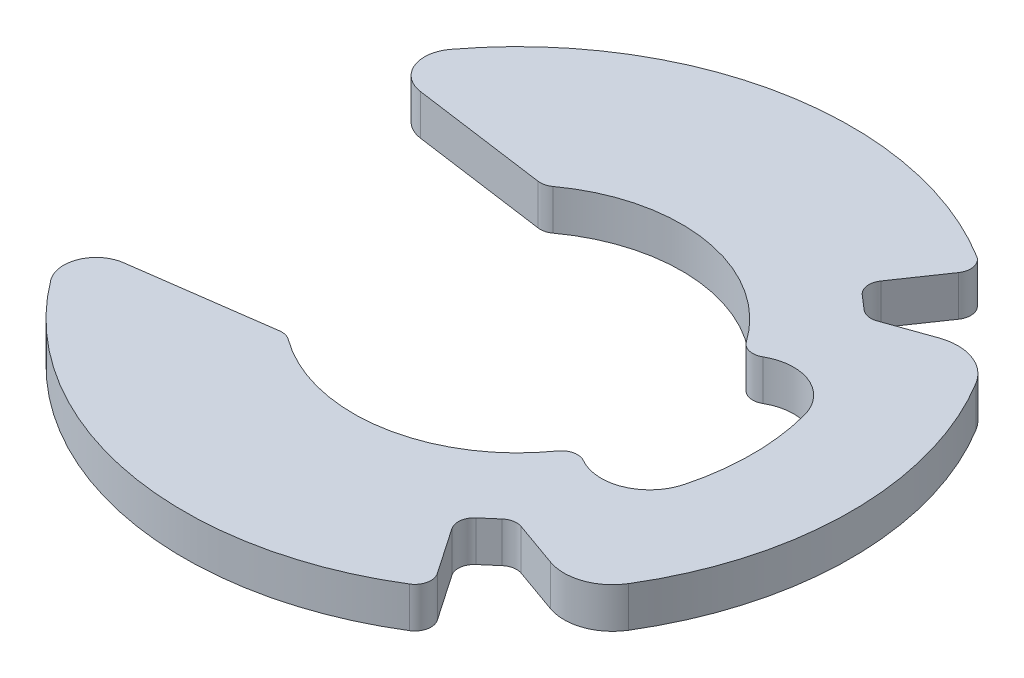
ISO-10303-21;
HEADER;
FILE_DESCRIPTION(('STEP AP214'),'2;1');
FILE_NAME('part.step','',(''),(''),'','','');
FILE_SCHEMA(('AUTOMOTIVE_DESIGN { 1 0 10303 214 1 1 1 1 }'));
ENDSEC;
DATA;
#1=APPLICATION_CONTEXT('core data for automotive mechanical design processes');
#2=APPLICATION_PROTOCOL_DEFINITION('international standard','automotive_design',2000,#1);
#3=PRODUCT_CONTEXT('',#1,'mechanical');
#4=PRODUCT('Part','Part','',(#3));
#5=PRODUCT_RELATED_PRODUCT_CATEGORY('part','',(#4));
#6=PRODUCT_DEFINITION_FORMATION('','',#4);
#7=PRODUCT_DEFINITION_CONTEXT('part definition',#1,'design');
#8=PRODUCT_DEFINITION('design','',#6,#7);
#9=PRODUCT_DEFINITION_SHAPE('','',#8);
#10=(LENGTH_UNIT() NAMED_UNIT(*) SI_UNIT(.MILLI.,.METRE.));
#11=(NAMED_UNIT(*) PLANE_ANGLE_UNIT() SI_UNIT($,.RADIAN.));
#12=(NAMED_UNIT(*) SI_UNIT($,.STERADIAN.) SOLID_ANGLE_UNIT());
#13=UNCERTAINTY_MEASURE_WITH_UNIT(LENGTH_MEASURE(1.E-05),#10,'distance_accuracy_value','');
#14=(GEOMETRIC_REPRESENTATION_CONTEXT(3) GLOBAL_UNCERTAINTY_ASSIGNED_CONTEXT((#13)) GLOBAL_UNIT_ASSIGNED_CONTEXT((#10,
#11,#12)) REPRESENTATION_CONTEXT('',''));
#15=CARTESIAN_POINT('',(0.,0.,0.));
#16=DIRECTION('',(0.,0.,1.));
#17=DIRECTION('',(1.,0.,0.));
#18=AXIS2_PLACEMENT_3D('',#15,#16,#17);
#19=CARTESIAN_POINT('',(0.,0.,0.));
#20=DIRECTION('',(0.,1.,0.));
#21=DIRECTION('',(0.,0.,1.));
#22=AXIS2_PLACEMENT_3D('',#19,#20,#21);
#23=PLANE('',#22);
#24=CARTESIAN_POINT('',(-22.07313236114,4.47034770312271E-10,-16.01345085594));
#25=DIRECTION('',(0.,-1.,0.));
#26=DIRECTION('',(0.,0.,-1.));
#27=AXIS2_PLACEMENT_3D('',#24,#25,#26);
#28=CIRCLE('',#27,0.50800000118196);
#29=CARTESIAN_POINT('',(-21.8057551545529,4.47034770312271E-10,-16.4453923260195));
#30=VERTEX_POINT('',#29);
#31=CARTESIAN_POINT('',(-21.6539452885202,4.47034811882136E-10,-15.7264905792936));
#32=VERTEX_POINT('',#31);
#33=EDGE_CURVE('E217',#30,#32,#28,.T.);
#34=ORIENTED_EDGE('',*,*,#33,.T.);
#35=DIRECTION('',(-0.564882433563304,0.,0.82517139810563));
#36=VECTOR('',#35,1.);
#37=CARTESIAN_POINT('',(-22.0748487406788,4.47034853452E-10,-15.1116414187447));
#38=LINE('',#37,#36);
#39=CARTESIAN_POINT('',(-22.6486653216856,4.47034770312271E-10,-14.2734191628065));
#40=VERTEX_POINT('',#39);
#41=EDGE_CURVE('E254',#32,#40,#38,.T.);
#42=ORIENTED_EDGE('',*,*,#41,.T.);
#43=CARTESIAN_POINT('',(-22.22947825114,4.47034770312271E-10,-13.98645888758));
#44=DIRECTION('',(0.,-1.,0.));
#45=DIRECTION('',(0.,0.,-1.));
#46=AXIS2_PLACEMENT_3D('',#43,#44,#45);
#47=CIRCLE('',#46,0.508000002280017);
#48=CARTESIAN_POINT('',(-22.5611715821282,4.47034811882136E-10,-13.6016946235873));
#49=VERTEX_POINT('',#48);
#50=EDGE_CURVE('E250',#40,#49,#47,.F.);
#51=ORIENTED_EDGE('',*,*,#50,.T.);
#52=DIRECTION('',(0.757409961678544,0.,0.652939621979021));
#53=VECTOR('',#52,1.);
#54=CARTESIAN_POINT('',(-2.89188515223315,4.47034853452E-10,3.35458677740044));
#55=LINE('',#54,#53);
#56=CARTESIAN_POINT('',(-22.1206645648755,4.47034770312271E-10,-13.2219471969928));
#57=VERTEX_POINT('',#56);
#58=EDGE_CURVE('E246',#49,#57,#55,.T.);
#59=ORIENTED_EDGE('',*,*,#58,.T.);
#60=CARTESIAN_POINT('',(-21.78897123528,0.,-13.6067114581));
#61=DIRECTION('',(0.,-1.,0.));
#62=DIRECTION('',(0.,0.,-1.));
#63=AXIS2_PLACEMENT_3D('',#60,#61,#62);
#64=CIRCLE('',#63,0.507999999762464);
#65=CARTESIAN_POINT('',(-21.6191707881146,0.,-13.1279298714654));
#66=VERTEX_POINT('',#65);
#67=EDGE_CURVE('E214',#57,#66,#64,.F.);
#68=ORIENTED_EDGE('',*,*,#67,.T.);
#69=DIRECTION('',(-0.942483439821768,0.,0.334252846901455));
#70=VECTOR('',#69,1.);
#71=CARTESIAN_POINT('',(-20.18646760006,0.,-13.63603972304));
#72=LINE('',#71,#70);
#73=CARTESIAN_POINT('',(-20.1864675987335,2.23517385156136E-10,-13.6360397235104));
#74=VERTEX_POINT('',#73);
#75=EDGE_CURVE('E210',#74,#66,#72,.T.);
#76=ORIENTED_EDGE('',*,*,#75,.F.);
#77=CARTESIAN_POINT('',(-19.6770662592,4.47034770312271E-10,-12.19969496302));
#78=DIRECTION('',(0.,-1.,0.));
#79=DIRECTION('',(0.,0.,-1.));
#80=AXIS2_PLACEMENT_3D('',#77,#78,#79);
#81=CIRCLE('',#80,1.5239999985915);
#82=CARTESIAN_POINT('',(-18.3760715779661,4.47034770312271E-10,-12.9934133257918));
#83=VERTEX_POINT('',#82);
#84=EDGE_CURVE('E20',#83,#74,#81,.F.);
#85=ORIENTED_EDGE('',*,*,#84,.F.);
#86=CARTESIAN_POINT('',(-27.3204100022,4.47034770312271E-10,-7.53659958514));
#87=DIRECTION('',(0.,-1.,0.));
#88=DIRECTION('',(0.,0.,-1.));
#89=AXIS2_PLACEMENT_3D('',#86,#87,#88);
#90=CIRCLE('',#89,10.4774999889218);
#91=CARTESIAN_POINT('',(-18.3760715791694,4.47034770312271E-10,-2.07978584547633));
#92=VERTEX_POINT('',#91);
#93=EDGE_CURVE('E401',#83,#92,#90,.T.);
#94=ORIENTED_EDGE('',*,*,#93,.T.);
#95=CARTESIAN_POINT('',(-19.6770662592,0.,-2.87350420726));
#96=DIRECTION('',(0.,-1.,0.));
#97=DIRECTION('',(0.,0.,-1.));
#98=AXIS2_PLACEMENT_3D('',#95,#96,#97);
#99=CIRCLE('',#98,1.523999999238);
#100=CARTESIAN_POINT('',(-20.1864676003209,2.23517426726E-10,-1.43715944347087));
#101=VERTEX_POINT('',#100);
#102=EDGE_CURVE('E399',#92,#101,#99,.T.);
#103=ORIENTED_EDGE('',*,*,#102,.T.);
#104=DIRECTION('',(-0.942483439574692,0.,-0.334252847598129));
#105=VECTOR('',#104,1.);
#106=CARTESIAN_POINT('',(-1.80258726924936,4.47034853452E-10,5.08270508946653));
#107=LINE('',#106,#105);
#108=CARTESIAN_POINT('',(-21.6191707898387,4.47034770312271E-10,-1.94526929709942));
#109=VERTEX_POINT('',#108);
#110=EDGE_CURVE('E275',#101,#109,#107,.T.);
#111=ORIENTED_EDGE('',*,*,#110,.T.);
#112=CARTESIAN_POINT('',(-21.78897123528,4.47034770312271E-10,-1.466487711164));
#113=DIRECTION('',(0.,-1.,0.));
#114=DIRECTION('',(0.,0.,-1.));
#115=AXIS2_PLACEMENT_3D('',#112,#113,#114);
#116=CIRCLE('',#115,0.50800000093334);
#117=CARTESIAN_POINT('',(-22.120664564575,4.47034811882136E-10,-1.85125197230361));
#118=VERTEX_POINT('',#117);
#119=EDGE_CURVE('E397',#109,#118,#116,.F.);
#120=ORIENTED_EDGE('',*,*,#119,.T.);
#121=DIRECTION('',(-0.757409961678544,0.,0.652939621979021));
#122=VECTOR('',#121,1.);
#123=CARTESIAN_POINT('',(-10.3462298969316,4.47034853452E-10,-12.0016266833385));
#124=LINE('',#123,#122);
#125=CARTESIAN_POINT('',(-22.5611715802731,4.47034770312271E-10,-1.47150454466788));
#126=VERTEX_POINT('',#125);
#127=EDGE_CURVE('E271',#118,#126,#124,.T.);
#128=ORIENTED_EDGE('',*,*,#127,.T.);
#129=CARTESIAN_POINT('',(-22.22947825114,4.47034770312271E-10,-1.086740283716));
#130=DIRECTION('',(0.,-1.,0.));
#131=DIRECTION('',(0.,0.,-1.));
#132=AXIS2_PLACEMENT_3D('',#129,#130,#131);
#133=CIRCLE('',#132,0.508000000775935);
#134=CARTESIAN_POINT('',(-22.6486653201538,4.47034811882136E-10,-0.799780008649158));
#135=VERTEX_POINT('',#134);
#136=EDGE_CURVE('E395',#126,#135,#133,.F.);
#137=ORIENTED_EDGE('',*,*,#136,.T.);
#138=DIRECTION('',(0.564882433563304,0.,0.82517139810563));
#139=VECTOR('',#138,1.);
#140=CARTESIAN_POINT('',(-15.048856378588,4.47034853452E-10,10.3019016812714));
#141=LINE('',#140,#139);
#142=CARTESIAN_POINT('',(-21.65394529083,4.47034770312271E-10,0.653291409725379));
#143=VERTEX_POINT('',#142);
#144=EDGE_CURVE('E267',#135,#143,#141,.T.);
#145=ORIENTED_EDGE('',*,*,#144,.T.);
#146=CARTESIAN_POINT('',(-22.07313236114,4.47034770312271E-10,0.940251686676));
#147=DIRECTION('',(0.,-1.,0.));
#148=DIRECTION('',(0.,0.,-1.));
#149=AXIS2_PLACEMENT_3D('',#146,#147,#148);
#150=CIRCLE('',#149,0.50799999882348);
#151=CARTESIAN_POINT('',(-21.8057551567268,4.47034770312271E-10,1.37219315238051));
#152=VERTEX_POINT('',#151);
#153=EDGE_CURVE('E392',#143,#152,#150,.T.);
#154=ORIENTED_EDGE('',*,*,#153,.T.);
#155=CARTESIAN_POINT('',(-27.3204100022,0.,-7.53659958514));
#156=DIRECTION('',(0.,-1.,0.));
#157=DIRECTION('',(0.,0.,-1.));
#158=AXIS2_PLACEMENT_3D('',#155,#156,#157);
#159=CIRCLE('',#158,10.4775);
#160=CARTESIAN_POINT('',(-35.7109114566552,2.47519251875367E-10,-1.26145085025943));
#161=VERTEX_POINT('',#160);
#162=EDGE_CURVE('E389',#152,#161,#159,.T.);
#163=ORIENTED_EDGE('',*,*,#162,.T.);
#164=CARTESIAN_POINT('',(-34.897287076,4.47034770312271E-10,-1.869950119884));
#165=DIRECTION('',(0.,-1.,0.));
#166=DIRECTION('',(0.,0.,-1.));
#167=AXIS2_PLACEMENT_3D('',#164,#165,#166);
#168=CIRCLE('',#167,1.01599999949862);
#169=CARTESIAN_POINT('',(-35.0366255019701,4.47034770312271E-10,-2.87635004495265));
#170=VERTEX_POINT('',#169);
#171=EDGE_CURVE('E386',#161,#170,#168,.T.);
#172=ORIENTED_EDGE('',*,*,#171,.T.);
#173=DIRECTION('',(0.990551105107822,0.,-0.137144114600928));
#174=VECTOR('',#173,1.);
#175=CARTESIAN_POINT('',(-1.0497337892879,4.47034631456E-10,-7.58191460183239));
#176=LINE('',#175,#174);
#177=CARTESIAN_POINT('',(-30.738662072202,4.47034770312271E-10,-3.47141312136189));
#178=VERTEX_POINT('',#177);
#179=EDGE_CURVE('E262',#170,#178,#176,.T.);
#180=ORIENTED_EDGE('',*,*,#179,.T.);
#181=CARTESIAN_POINT('',(-30.6689928656,4.47034770312271E-10,-2.96821315932));
#182=DIRECTION('',(0.,-1.,0.));
#183=DIRECTION('',(0.,0.,-1.));
#184=AXIS2_PLACEMENT_3D('',#181,#182,#183);
#185=CIRCLE('',#184,0.508000000000001);
#186=CARTESIAN_POINT('',(-30.368671526695,4.47034770312271E-10,-3.37793391468232));
#187=VERTEX_POINT('',#186);
#188=EDGE_CURVE('E383',#178,#187,#185,.T.);
#189=ORIENTED_EDGE('',*,*,#188,.T.);
#190=CARTESIAN_POINT('',(-27.3204100022,0.,-7.53659958514));
#191=DIRECTION('',(0.,-1.,0.));
#192=DIRECTION('',(0.,0.,-1.));
#193=AXIS2_PLACEMENT_3D('',#190,#191,#192);
#194=CIRCLE('',#193,5.15619998974764);
#195=CARTESIAN_POINT('',(-23.1042244003276,2.03470982844795E-10,-4.56840530160036));
#196=VERTEX_POINT('',#195);
#197=EDGE_CURVE('E379',#187,#196,#194,.F.);
#198=ORIENTED_EDGE('',*,*,#197,.T.);
#199=CARTESIAN_POINT('',(-22.68883665424,4.47034770312271E-10,-4.27597236752));
#200=DIRECTION('',(0.,-1.,0.));
#201=DIRECTION('',(0.,0.,-1.));
#202=AXIS2_PLACEMENT_3D('',#199,#200,#201);
#203=CIRCLE('',#202,0.508);
#204=CARTESIAN_POINT('',(-22.4351958276829,4.47034770312271E-10,-4.71612044585406));
#205=VERTEX_POINT('',#204);
#206=EDGE_CURVE('E375',#196,#205,#203,.T.);
#207=ORIENTED_EDGE('',*,*,#206,.T.);
#208=CARTESIAN_POINT('',(-21.67427334682,0.,-6.03656468072));
#209=DIRECTION('',(0.,-1.,0.));
#210=DIRECTION('',(0.,0.,-1.));
#211=AXIS2_PLACEMENT_3D('',#208,#209,#210);
#212=CIRCLE('',#211,1.52400000241032);
#213=CARTESIAN_POINT('',(-20.201368126617,1.652085018479E-10,-5.6452512262548));
#214=VERTEX_POINT('',#213);
#215=EDGE_CURVE('E372',#205,#214,#212,.F.);
#216=ORIENTED_EDGE('',*,*,#215,.T.);
#217=CARTESIAN_POINT('',(-27.3204100022,4.47034770312271E-10,-7.53659958514));
#218=DIRECTION('',(0.,-1.,0.));
#219=DIRECTION('',(0.,0.,-1.));
#220=AXIS2_PLACEMENT_3D('',#217,#218,#219);
#221=CIRCLE('',#220,7.36599998920456);
#222=CARTESIAN_POINT('',(-20.2013681277818,4.47034770312271E-10,-9.42794794371576));
#223=VERTEX_POINT('',#222);
#224=EDGE_CURVE('E368',#214,#223,#221,.F.);
#225=ORIENTED_EDGE('',*,*,#224,.T.);
#226=CARTESIAN_POINT('',(-21.67427334682,4.47034770312271E-10,-9.03663448956));
#227=DIRECTION('',(0.,-1.,0.));
#228=DIRECTION('',(0.,0.,-1.));
#229=AXIS2_PLACEMENT_3D('',#226,#227,#228);
#230=CIRCLE('',#229,1.52399999995939);
#231=CARTESIAN_POINT('',(-22.4351958277817,4.47034770312271E-10,-10.3570787245974));
#232=VERTEX_POINT('',#231);
#233=EDGE_CURVE('E364',#223,#232,#230,.F.);
#234=ORIENTED_EDGE('',*,*,#233,.T.);
#235=CARTESIAN_POINT('',(-22.68883665424,0.,-10.79722680276));
#236=DIRECTION('',(0.,-1.,0.));
#237=DIRECTION('',(0.,0.,-1.));
#238=AXIS2_PLACEMENT_3D('',#235,#236,#237);
#239=CIRCLE('',#238,0.508);
#240=CARTESIAN_POINT('',(-23.1042243959208,2.43563787446714E-10,-10.504793871782));
#241=VERTEX_POINT('',#240);
#242=EDGE_CURVE('E360',#232,#241,#239,.T.);
#243=ORIENTED_EDGE('',*,*,#242,.T.);
#244=CARTESIAN_POINT('',(-27.3204100022,4.47034770312271E-10,-7.53659958514));
#245=DIRECTION('',(0.,-1.,0.));
#246=DIRECTION('',(0.,0.,-1.));
#247=AXIS2_PLACEMENT_3D('',#244,#245,#246);
#248=CIRCLE('',#247,5.15620000031233);
#249=CARTESIAN_POINT('',(-30.3686715245659,4.47034770312271E-10,-11.695265252693));
#250=VERTEX_POINT('',#249);
#251=EDGE_CURVE('E356',#241,#250,#248,.F.);
#252=ORIENTED_EDGE('',*,*,#251,.T.);
#253=CARTESIAN_POINT('',(-30.6689928656,0.,-12.10498601096));
#254=DIRECTION('',(0.,-1.,0.));
#255=DIRECTION('',(0.,0.,-1.));
#256=AXIS2_PLACEMENT_3D('',#253,#254,#255);
#257=CIRCLE('',#256,0.508000000000002);
#258=CARTESIAN_POINT('',(-30.7386620715904,2.23517426726E-10,-11.6017860533358));
#259=VERTEX_POINT('',#258);
#260=EDGE_CURVE('E353',#250,#259,#257,.T.);
#261=ORIENTED_EDGE('',*,*,#260,.T.);
#262=DIRECTION('',(-0.990551105107822,0.,-0.137144114600928));
#263=VECTOR('',#262,1.);
#264=CARTESIAN_POINT('',(0.997934005142403,4.47034853452E-10,-7.20778018433313));
#265=LINE('',#264,#263);
#266=CARTESIAN_POINT('',(-35.0366255014659,4.47034770312271E-10,-12.196849128461));
#267=VERTEX_POINT('',#266);
#268=EDGE_CURVE('E258',#259,#267,#265,.T.);
#269=ORIENTED_EDGE('',*,*,#268,.T.);
#270=CARTESIAN_POINT('',(-34.897287076,4.47034770312271E-10,-13.20324904938));
#271=DIRECTION('',(0.,-1.,0.));
#272=DIRECTION('',(0.,0.,-1.));
#273=AXIS2_PLACEMENT_3D('',#270,#271,#272);
#274=CIRCLE('',#273,1.01600000134047);
#275=CARTESIAN_POINT('',(-35.7109114594095,4.47034770312271E-10,-13.8117483218989));
#276=VERTEX_POINT('',#275);
#277=EDGE_CURVE('E350',#267,#276,#274,.T.);
#278=ORIENTED_EDGE('',*,*,#277,.T.);
#279=CARTESIAN_POINT('',(-27.3204100022,4.47034770312271E-10,-7.53659958514));
#280=DIRECTION('',(0.,-1.,0.));
#281=DIRECTION('',(0.,0.,-1.));
#282=AXIS2_PLACEMENT_3D('',#279,#280,#281);
#283=CIRCLE('',#282,10.4775);
#284=EDGE_CURVE('E346',#276,#30,#283,.T.);
#285=ORIENTED_EDGE('',*,*,#284,.T.);
#286=EDGE_LOOP('',(#34,#42,#51,#59,#68,#76,#85,#94,#103,#111,#120,#128,#137,#145,#154,#163,#172,
#180,#189,#198,#207,#216,#225,#234,#243,#252,#261,#269,#278,#285));
#287=FACE_BOUND('',#286,.T.);
#288=ADVANCED_FACE('F17',(#287),#23,.F.);
#289=CARTESIAN_POINT('',(-22.07313236114,1.27,-16.01345085594));
#290=DIRECTION('',(0.,-1.,0.));
#291=DIRECTION('',(0.,0.,-1.));
#292=AXIS2_PLACEMENT_3D('',#289,#290,#291);
#293=CYLINDRICAL_SURFACE('',#292,0.50800000118196);
#294=DIRECTION('',(0.,1.,0.));
#295=VECTOR('',#294,1.);
#296=CARTESIAN_POINT('',(-21.8057551534168,0.635000000223518,-16.4453923287609));
#297=LINE('',#296,#295);
#298=CARTESIAN_POINT('',(-21.8057551545529,1.27,-16.4453923260195));
#299=VERTEX_POINT('',#298);
#300=EDGE_CURVE('E237',#30,#299,#297,.T.);
#301=ORIENTED_EDGE('',*,*,#300,.T.);
#302=CARTESIAN_POINT('',(-22.07313236114,1.27,-16.01345085594));
#303=DIRECTION('',(0.,-1.,0.));
#304=DIRECTION('',(0.,0.,-1.));
#305=AXIS2_PLACEMENT_3D('',#302,#303,#304);
#306=CIRCLE('',#305,0.50800000118196);
#307=CARTESIAN_POINT('',(-21.6539452895408,1.27,-15.7264905799429));
#308=VERTEX_POINT('',#307);
#309=EDGE_CURVE('E231',#299,#308,#306,.T.);
#310=ORIENTED_EDGE('',*,*,#309,.T.);
#311=DIRECTION('',(0.,1.,0.));
#312=VECTOR('',#311,1.);
#313=CARTESIAN_POINT('',(-21.6539452879448,0.,-15.7264905801342));
#314=LINE('',#313,#312);
#315=EDGE_CURVE('E255',#308,#32,#314,.F.);
#316=ORIENTED_EDGE('',*,*,#315,.T.);
#317=ORIENTED_EDGE('',*,*,#33,.F.);
#318=EDGE_LOOP('',(#301,#310,#316,#317));
#319=FACE_BOUND('',#318,.T.);
#320=ADVANCED_FACE('F413',(#319),#293,.T.);
#321=CARTESIAN_POINT('',(-22.0748487406788,0.,-15.1116414187447));
#322=DIRECTION('',(-0.82517139810563,0.,-0.564882433563304));
#323=DIRECTION('',(-0.564882433563304,0.,0.82517139810563));
#324=AXIS2_PLACEMENT_3D('',#321,#322,#323);
#325=PLANE('',#324);
#326=ORIENTED_EDGE('',*,*,#315,.F.);
#327=DIRECTION('',(-0.564882433695471,0.,0.825171398015153));
#328=VECTOR('',#327,1.);
#329=CARTESIAN_POINT('',(-21.65394528994,1.27,-15.7264905815));
#330=LINE('',#329,#328);
#331=CARTESIAN_POINT('',(-22.6486653227766,1.27,-14.2734191636026));
#332=VERTEX_POINT('',#331);
#333=EDGE_CURVE('E235',#308,#332,#330,.T.);
#334=ORIENTED_EDGE('',*,*,#333,.T.);
#335=DIRECTION('',(0.,1.,0.));
#336=VECTOR('',#335,1.);
#337=CARTESIAN_POINT('',(-22.6486653244099,0.635000000223518,-14.273419163437));
#338=LINE('',#337,#336);
#339=EDGE_CURVE('E251',#332,#40,#338,.F.);
#340=ORIENTED_EDGE('',*,*,#339,.T.);
#341=ORIENTED_EDGE('',*,*,#41,.F.);
#342=EDGE_LOOP('',(#326,#334,#340,#341));
#343=FACE_BOUND('',#342,.T.);
#344=ADVANCED_FACE('F410',(#343),#325,.F.);
#345=CARTESIAN_POINT('',(-22.22947825114,1.27,-13.98645888758));
#346=DIRECTION('',(0.,-1.,0.));
#347=DIRECTION('',(0.,0.,-1.));
#348=AXIS2_PLACEMENT_3D('',#345,#346,#347);
#349=CYLINDRICAL_SURFACE('',#348,0.508000002280017);
#350=ORIENTED_EDGE('',*,*,#339,.F.);
#351=CARTESIAN_POINT('',(-22.22947825114,1.27,-13.98645888758));
#352=DIRECTION('',(0.,-1.,0.));
#353=DIRECTION('',(0.,0.,-1.));
#354=AXIS2_PLACEMENT_3D('',#351,#352,#353);
#355=CIRCLE('',#354,0.508000002280017);
#356=CARTESIAN_POINT('',(-22.5611715812639,1.27,-13.60169462437));
#357=VERTEX_POINT('',#356);
#358=EDGE_CURVE('E343',#332,#357,#355,.F.);
#359=ORIENTED_EDGE('',*,*,#358,.T.);
#360=DIRECTION('',(0.,1.,0.));
#361=VECTOR('',#360,1.);
#362=CARTESIAN_POINT('',(-22.5611715821511,0.,-13.6016946236071));
#363=LINE('',#362,#361);
#364=EDGE_CURVE('E247',#357,#49,#363,.F.);
#365=ORIENTED_EDGE('',*,*,#364,.T.);
#366=ORIENTED_EDGE('',*,*,#50,.F.);
#367=EDGE_LOOP('',(#350,#359,#365,#366));
#368=FACE_BOUND('',#367,.T.);
#369=ADVANCED_FACE('F552',(#368),#349,.F.);
#370=CARTESIAN_POINT('',(-2.89188515223315,0.,3.35458677740044));
#371=DIRECTION('',(-0.652939621979021,0.,0.757409961678544));
#372=DIRECTION('',(0.757409961678544,0.,0.652939621979021));
#373=AXIS2_PLACEMENT_3D('',#370,#371,#372);
#374=PLANE('',#373);
#375=ORIENTED_EDGE('',*,*,#364,.F.);
#376=DIRECTION('',(0.757409962047436,0.,0.652939621551106));
#377=VECTOR('',#376,1.);
#378=CARTESIAN_POINT('',(-22.56117158064,1.27,-13.60169462536));
#379=LINE('',#378,#377);
#380=CARTESIAN_POINT('',(-22.120664563904,1.27,-13.2219471979));
#381=VERTEX_POINT('',#380);
#382=EDGE_CURVE('E342',#357,#381,#379,.T.);
#383=ORIENTED_EDGE('',*,*,#382,.T.);
#384=DIRECTION('',(0.,1.,0.));
#385=VECTOR('',#384,1.);
#386=CARTESIAN_POINT('',(-22.1206645645474,0.635,-13.2219471986898));
#387=LINE('',#386,#385);
#388=EDGE_CURVE('E243',#381,#57,#387,.F.);
#389=ORIENTED_EDGE('',*,*,#388,.T.);
#390=ORIENTED_EDGE('',*,*,#58,.F.);
#391=EDGE_LOOP('',(#375,#383,#389,#390));
#392=FACE_BOUND('',#391,.T.);
#393=ADVANCED_FACE('F550',(#392),#374,.F.);
#394=CARTESIAN_POINT('',(-21.78897123528,1.27,-13.6067114581));
#395=DIRECTION('',(0.,-1.,0.));
#396=DIRECTION('',(0.,0.,-1.));
#397=AXIS2_PLACEMENT_3D('',#394,#395,#396);
#398=CYLINDRICAL_SURFACE('',#397,0.507999999762464);
#399=DIRECTION('',(0.,1.,0.));
#400=VECTOR('',#399,1.);
#401=CARTESIAN_POINT('',(-21.6191707865793,0.,-13.1279298705803));
#402=LINE('',#401,#400);
#403=CARTESIAN_POINT('',(-21.6191707881146,1.27,-13.1279298714654));
#404=VERTEX_POINT('',#403);
#405=EDGE_CURVE('E232',#404,#66,#402,.F.);
#406=ORIENTED_EDGE('',*,*,#405,.T.);
#407=ORIENTED_EDGE('',*,*,#67,.F.);
#408=ORIENTED_EDGE('',*,*,#388,.F.);
#409=CARTESIAN_POINT('',(-21.78897123528,1.27,-13.6067114581));
#410=DIRECTION('',(0.,-1.,0.));
#411=DIRECTION('',(0.,0.,-1.));
#412=AXIS2_PLACEMENT_3D('',#409,#410,#411);
#413=CIRCLE('',#412,0.507999999762464);
#414=EDGE_CURVE('E339',#381,#404,#413,.F.);
#415=ORIENTED_EDGE('',*,*,#414,.T.);
#416=EDGE_LOOP('',(#406,#407,#408,#415));
#417=FACE_BOUND('',#416,.T.);
#418=ADVANCED_FACE('F546',(#417),#398,.F.);
#419=CARTESIAN_POINT('',(-27.3204100022,1.27,-7.53659958514));
#420=DIRECTION('',(0.,-1.,0.));
#421=DIRECTION('',(0.,0.,-1.));
#422=AXIS2_PLACEMENT_3D('',#419,#420,#421);
#423=CYLINDRICAL_SURFACE('',#422,10.4774999889218);
#424=DIRECTION('',(0.,1.,0.));
#425=VECTOR('',#424,1.);
#426=CARTESIAN_POINT('',(-18.3760715777967,0.635000000223518,-12.9934133255141));
#427=LINE('',#426,#425);
#428=CARTESIAN_POINT('',(-18.3760715785678,1.27,-12.9934133254247));
#429=VERTEX_POINT('',#428);
#430=EDGE_CURVE('E227',#83,#429,#427,.T.);
#431=ORIENTED_EDGE('',*,*,#430,.T.);
#432=CARTESIAN_POINT('',(-27.3204100022,1.27,-7.53659958514));
#433=DIRECTION('',(0.,-1.,0.));
#434=DIRECTION('',(0.,0.,-1.));
#435=AXIS2_PLACEMENT_3D('',#432,#433,#434);
#436=CIRCLE('',#435,10.4774999889218);
#437=CARTESIAN_POINT('',(-18.3760715792823,1.27,-2.07978584554522));
#438=VERTEX_POINT('',#437);
#439=EDGE_CURVE('E337',#429,#438,#436,.T.);
#440=ORIENTED_EDGE('',*,*,#439,.T.);
#441=DIRECTION('',(0.,-1.,0.));
#442=VECTOR('',#441,1.);
#443=CARTESIAN_POINT('',(-18.376071579,0.635,-2.079785846008));
#444=LINE('',#443,#442);
#445=EDGE_CURVE('E240',#438,#92,#444,.T.);
#446=ORIENTED_EDGE('',*,*,#445,.T.);
#447=ORIENTED_EDGE('',*,*,#93,.F.);
#448=EDGE_LOOP('',(#431,#440,#446,#447));
#449=FACE_BOUND('',#448,.T.);
#450=ADVANCED_FACE('F543',(#449),#423,.T.);
#451=CARTESIAN_POINT('',(-19.6770662592,1.27,-2.87350420726));
#452=DIRECTION('',(0.,-1.,0.));
#453=DIRECTION('',(0.,0.,-1.));
#454=AXIS2_PLACEMENT_3D('',#451,#452,#453);
#455=CYLINDRICAL_SURFACE('',#454,1.523999999238);
#456=CARTESIAN_POINT('',(-19.6770662592,1.27,-2.87350420726));
#457=DIRECTION('',(0.,-1.,0.));
#458=DIRECTION('',(0.,0.,-1.));
#459=AXIS2_PLACEMENT_3D('',#456,#457,#458);
#460=CIRCLE('',#459,1.523999999238);
#461=CARTESIAN_POINT('',(-20.1864675999586,1.27,-1.4371594447652));
#462=VERTEX_POINT('',#461);
#463=EDGE_CURVE('E334',#438,#462,#460,.T.);
#464=ORIENTED_EDGE('',*,*,#463,.T.);
#465=DIRECTION('',(0.,1.,0.));
#466=VECTOR('',#465,1.);
#467=CARTESIAN_POINT('',(-20.1864676009565,0.,-1.43715944369629));
#468=LINE('',#467,#466);
#469=EDGE_CURVE('E279',#462,#101,#468,.F.);
#470=ORIENTED_EDGE('',*,*,#469,.T.);
#471=ORIENTED_EDGE('',*,*,#102,.F.);
#472=ORIENTED_EDGE('',*,*,#445,.F.);
#473=EDGE_LOOP('',(#464,#470,#471,#472));
#474=FACE_BOUND('',#473,.T.);
#475=ADVANCED_FACE('F466',(#474),#455,.T.);
#476=CARTESIAN_POINT('',(-1.80258726924936,0.,5.08270508946653));
#477=DIRECTION('',(0.334252847598129,0.,-0.942483439574692));
#478=DIRECTION('',(-0.942483439574692,0.,-0.334252847598129));
#479=AXIS2_PLACEMENT_3D('',#476,#477,#478);
#480=PLANE('',#479);
#481=ORIENTED_EDGE('',*,*,#469,.F.);
#482=DIRECTION('',(-0.942483439534707,0.,-0.334252847710873));
#483=VECTOR('',#482,1.);
#484=CARTESIAN_POINT('',(-20.18646760006,1.27,-1.437159446224));
#485=LINE('',#484,#483);
#486=CARTESIAN_POINT('',(-21.6191707893314,1.27,-1.94526929843882));
#487=VERTEX_POINT('',#486);
#488=EDGE_CURVE('E333',#462,#487,#485,.T.);
#489=ORIENTED_EDGE('',*,*,#488,.T.);
#490=DIRECTION('',(0.,1.,0.));
#491=VECTOR('',#490,1.);
#492=CARTESIAN_POINT('',(-21.6191707898606,0.635000000223518,-1.9452692988795));
#493=LINE('',#492,#491);
#494=EDGE_CURVE('E278',#487,#109,#493,.F.);
#495=ORIENTED_EDGE('',*,*,#494,.T.);
#496=ORIENTED_EDGE('',*,*,#110,.F.);
#497=EDGE_LOOP('',(#481,#489,#495,#496));
#498=FACE_BOUND('',#497,.T.);
#499=ADVANCED_FACE('F472',(#498),#480,.F.);
#500=CARTESIAN_POINT('',(-21.78897123528,1.27,-1.466487711164));
#501=DIRECTION('',(0.,-1.,0.));
#502=DIRECTION('',(0.,0.,-1.));
#503=AXIS2_PLACEMENT_3D('',#500,#501,#502);
#504=CYLINDRICAL_SURFACE('',#503,0.50800000093334);
#505=CARTESIAN_POINT('',(-21.78897123528,1.27,-1.466487711164));
#506=DIRECTION('',(0.,-1.,0.));
#507=DIRECTION('',(0.,0.,-1.));
#508=AXIS2_PLACEMENT_3D('',#505,#506,#507);
#509=CIRCLE('',#508,0.50800000093334);
#510=CARTESIAN_POINT('',(-22.1206645644648,1.27,-1.85125197213819));
#511=VERTEX_POINT('',#510);
#512=EDGE_CURVE('E330',#487,#511,#509,.F.);
#513=ORIENTED_EDGE('',*,*,#512,.T.);
#514=DIRECTION('',(0.,1.,0.));
#515=VECTOR('',#514,1.);
#516=CARTESIAN_POINT('',(-22.1206645650376,0.,-1.8512519719048));
#517=LINE('',#516,#515);
#518=EDGE_CURVE('E274',#511,#118,#517,.F.);
#519=ORIENTED_EDGE('',*,*,#518,.T.);
#520=ORIENTED_EDGE('',*,*,#119,.F.);
#521=ORIENTED_EDGE('',*,*,#494,.F.);
#522=EDGE_LOOP('',(#513,#519,#520,#521));
#523=FACE_BOUND('',#522,.T.);
#524=ADVANCED_FACE('F541',(#523),#504,.F.);
#525=CARTESIAN_POINT('',(-10.3462298969316,0.,-12.0016266833385));
#526=DIRECTION('',(-0.652939621979021,0.,-0.757409961678544));
#527=DIRECTION('',(-0.757409961678544,0.,0.652939621979021));
#528=AXIS2_PLACEMENT_3D('',#525,#526,#527);
#529=PLANE('',#528);
#530=ORIENTED_EDGE('',*,*,#518,.F.);
#531=DIRECTION('',(-0.757409961615473,0.,0.652939622052183));
#532=VECTOR('',#531,1.);
#533=CARTESIAN_POINT('',(-22.12066456478,1.27,-1.851251971606));
#534=LINE('',#533,#532);
#535=CARTESIAN_POINT('',(-22.5611715801446,1.27,-1.47150454448118));
#536=VERTEX_POINT('',#535);
#537=EDGE_CURVE('E329',#511,#536,#534,.T.);
#538=ORIENTED_EDGE('',*,*,#537,.T.);
#539=DIRECTION('',(0.,1.,0.));
#540=VECTOR('',#539,1.);
#541=CARTESIAN_POINT('',(-22.5611715805372,0.635000000223518,-1.47150454403878));
#542=LINE('',#541,#540);
#543=EDGE_CURVE('E273',#536,#126,#542,.F.);
#544=ORIENTED_EDGE('',*,*,#543,.T.);
#545=ORIENTED_EDGE('',*,*,#127,.F.);
#546=EDGE_LOOP('',(#530,#538,#544,#545));
#547=FACE_BOUND('',#546,.T.);
#548=ADVANCED_FACE('F538',(#547),#529,.F.);
#549=CARTESIAN_POINT('',(-22.22947825114,1.27,-1.086740283716));
#550=DIRECTION('',(0.,-1.,0.));
#551=DIRECTION('',(0.,0.,-1.));
#552=AXIS2_PLACEMENT_3D('',#549,#550,#551);
#553=CYLINDRICAL_SURFACE('',#552,0.508000000775935);
#554=ORIENTED_EDGE('',*,*,#543,.F.);
#555=CARTESIAN_POINT('',(-22.22947825114,1.27,-1.086740283716));
#556=DIRECTION('',(0.,-1.,0.));
#557=DIRECTION('',(0.,0.,-1.));
#558=AXIS2_PLACEMENT_3D('',#555,#556,#557);
#559=CIRCLE('',#558,0.508000000775935);
#560=CARTESIAN_POINT('',(-22.6486653212323,1.27,-0.799780008052315));
#561=VERTEX_POINT('',#560);
#562=EDGE_CURVE('E326',#536,#561,#559,.F.);
#563=ORIENTED_EDGE('',*,*,#562,.T.);
#564=DIRECTION('',(0.,1.,0.));
#565=VECTOR('',#564,1.);
#566=CARTESIAN_POINT('',(-22.6486653203148,0.,-0.799780008884393));
#567=LINE('',#566,#565);
#568=EDGE_CURVE('E270',#561,#135,#567,.F.);
#569=ORIENTED_EDGE('',*,*,#568,.T.);
#570=ORIENTED_EDGE('',*,*,#136,.F.);
#571=EDGE_LOOP('',(#554,#563,#569,#570));
#572=FACE_BOUND('',#571,.T.);
#573=ADVANCED_FACE('F536',(#572),#553,.F.);
#574=CARTESIAN_POINT('',(-15.048856378588,0.,10.3019016812714));
#575=DIRECTION('',(-0.82517139810563,0.,0.564882433563304));
#576=DIRECTION('',(0.564882433563304,0.,0.82517139810563));
#577=AXIS2_PLACEMENT_3D('',#574,#575,#576);
#578=PLANE('',#577);
#579=ORIENTED_EDGE('',*,*,#568,.F.);
#580=DIRECTION('',(0.564882433183959,0.,0.825171398365315));
#581=VECTOR('',#580,1.);
#582=CARTESIAN_POINT('',(-22.64866532234,1.27,-0.799780007498));
#583=LINE('',#582,#581);
#584=CARTESIAN_POINT('',(-21.6539452921106,1.27,0.653291410743572));
#585=VERTEX_POINT('',#584);
#586=EDGE_CURVE('E325',#561,#585,#583,.T.);
#587=ORIENTED_EDGE('',*,*,#586,.T.);
#588=DIRECTION('',(0.,-1.,0.));
#589=VECTOR('',#588,1.);
#590=CARTESIAN_POINT('',(-21.65394529248,0.635000000223518,0.653291410204));
#591=LINE('',#590,#589);
#592=EDGE_CURVE('E269',#585,#143,#591,.T.);
#593=ORIENTED_EDGE('',*,*,#592,.T.);
#594=ORIENTED_EDGE('',*,*,#144,.F.);
#595=EDGE_LOOP('',(#579,#587,#593,#594));
#596=FACE_BOUND('',#595,.T.);
#597=ADVANCED_FACE('F532',(#596),#578,.F.);
#598=CARTESIAN_POINT('',(-22.07313236114,1.27,0.940251686676));
#599=DIRECTION('',(0.,-1.,0.));
#600=DIRECTION('',(0.,0.,-1.));
#601=AXIS2_PLACEMENT_3D('',#598,#599,#600);
#602=CYLINDRICAL_SURFACE('',#601,0.50799999882348);
#603=ORIENTED_EDGE('',*,*,#592,.F.);
#604=CARTESIAN_POINT('',(-22.07313236114,1.27,0.940251686676));
#605=DIRECTION('',(0.,-1.,0.));
#606=DIRECTION('',(0.,0.,-1.));
#607=AXIS2_PLACEMENT_3D('',#604,#605,#606);
#608=CIRCLE('',#607,0.50799999882348);
#609=CARTESIAN_POINT('',(-21.805755156504,1.27,1.37219315274047));
#610=VERTEX_POINT('',#609);
#611=EDGE_CURVE('E322',#585,#610,#608,.T.);
#612=ORIENTED_EDGE('',*,*,#611,.T.);
#613=DIRECTION('',(0.,-1.,0.));
#614=VECTOR('',#613,1.);
#615=CARTESIAN_POINT('',(-21.8057551565,0.635,1.372193152738));
#616=LINE('',#615,#614);
#617=EDGE_CURVE('E391',#610,#152,#616,.T.);
#618=ORIENTED_EDGE('',*,*,#617,.T.);
#619=ORIENTED_EDGE('',*,*,#153,.F.);
#620=EDGE_LOOP('',(#603,#612,#618,#619));
#621=FACE_BOUND('',#620,.T.);
#622=ADVANCED_FACE('F605',(#621),#602,.T.);
#623=CARTESIAN_POINT('',(-27.3204100022,1.27,-7.53659958514));
#624=DIRECTION('',(0.,-1.,0.));
#625=DIRECTION('',(0.,0.,-1.));
#626=AXIS2_PLACEMENT_3D('',#623,#624,#625);
#627=CYLINDRICAL_SURFACE('',#626,10.4775);
#628=CARTESIAN_POINT('',(-27.3204100022,1.27,-7.53659958514));
#629=DIRECTION('',(0.,-1.,0.));
#630=DIRECTION('',(0.,0.,-1.));
#631=AXIS2_PLACEMENT_3D('',#628,#629,#630);
#632=CIRCLE('',#631,10.4775);
#633=CARTESIAN_POINT('',(-35.7109114586458,1.27,-1.26145084877069));
#634=VERTEX_POINT('',#633);
#635=EDGE_CURVE('E319',#610,#634,#632,.T.);
#636=ORIENTED_EDGE('',*,*,#635,.T.);
#637=DIRECTION('',(0.,-1.,0.));
#638=VECTOR('',#637,1.);
#639=CARTESIAN_POINT('',(-35.7109114584,0.635000000223518,-1.261450848442));
#640=LINE('',#639,#638);
#641=EDGE_CURVE('E388',#634,#161,#640,.T.);
#642=ORIENTED_EDGE('',*,*,#641,.T.);
#643=ORIENTED_EDGE('',*,*,#162,.F.);
#644=ORIENTED_EDGE('',*,*,#617,.F.);
#645=EDGE_LOOP('',(#636,#642,#643,#644));
#646=FACE_BOUND('',#645,.T.);
#647=ADVANCED_FACE('F525',(#646),#627,.T.);
#648=CARTESIAN_POINT('',(-34.897287076,1.27,-1.869950119884));
#649=DIRECTION('',(0.,-1.,0.));
#650=DIRECTION('',(0.,0.,-1.));
#651=AXIS2_PLACEMENT_3D('',#648,#649,#650);
#652=CYLINDRICAL_SURFACE('',#651,1.01599999949862);
#653=ORIENTED_EDGE('',*,*,#641,.F.);
#654=CARTESIAN_POINT('',(-34.897287076,1.27,-1.869950119884));
#655=DIRECTION('',(0.,-1.,0.));
#656=DIRECTION('',(0.,0.,-1.));
#657=AXIS2_PLACEMENT_3D('',#654,#655,#656);
#658=CIRCLE('',#657,1.01599999949862);
#659=CARTESIAN_POINT('',(-35.0366255017196,1.27,-2.87635004464921));
#660=VERTEX_POINT('',#659);
#661=EDGE_CURVE('E316',#634,#660,#658,.T.);
#662=ORIENTED_EDGE('',*,*,#661,.T.);
#663=DIRECTION('',(0.,1.,0.));
#664=VECTOR('',#663,1.);
#665=CARTESIAN_POINT('',(-35.0366255070919,0.,-2.87635004424353));
#666=LINE('',#665,#664);
#667=EDGE_CURVE('E266',#660,#170,#666,.F.);
#668=ORIENTED_EDGE('',*,*,#667,.T.);
#669=ORIENTED_EDGE('',*,*,#171,.F.);
#670=EDGE_LOOP('',(#653,#662,#668,#669));
#671=FACE_BOUND('',#670,.T.);
#672=ADVANCED_FACE('F522',(#671),#652,.T.);
#673=CARTESIAN_POINT('',(-1.0497337892879,0.,-7.58191460183239));
#674=DIRECTION('',(0.137144114600928,0.,0.990551105107822));
#675=DIRECTION('',(0.990551105107822,0.,-0.137144114600928));
#676=AXIS2_PLACEMENT_3D('',#673,#674,#675);
#677=PLANE('',#676);
#678=ORIENTED_EDGE('',*,*,#667,.F.);
#679=DIRECTION('',(0.990551105163562,0.,-0.137144114198334));
#680=VECTOR('',#679,1.);
#681=CARTESIAN_POINT('',(-35.036625507,1.27,-2.87635004358));
#682=LINE('',#681,#680);
#683=CARTESIAN_POINT('',(-30.7386620719329,1.27,-3.47141312017086));
#684=VERTEX_POINT('',#683);
#685=EDGE_CURVE('E315',#660,#684,#682,.T.);
#686=ORIENTED_EDGE('',*,*,#685,.T.);
#687=DIRECTION('',(0.,-1.,0.));
#688=VECTOR('',#687,1.);
#689=CARTESIAN_POINT('',(-30.7386620684,0.635000000223518,-3.47141312066));
#690=LINE('',#689,#688);
#691=EDGE_CURVE('E265',#684,#178,#690,.T.);
#692=ORIENTED_EDGE('',*,*,#691,.T.);
#693=ORIENTED_EDGE('',*,*,#179,.F.);
#694=EDGE_LOOP('',(#678,#686,#692,#693));
#695=FACE_BOUND('',#694,.T.);
#696=ADVANCED_FACE('F519',(#695),#677,.F.);
#697=CARTESIAN_POINT('',(-30.6689928656,1.27,-2.96821315932));
#698=DIRECTION('',(0.,-1.,0.));
#699=DIRECTION('',(0.,0.,-1.));
#700=AXIS2_PLACEMENT_3D('',#697,#698,#699);
#701=CYLINDRICAL_SURFACE('',#700,0.508000000000001);
#702=CARTESIAN_POINT('',(-30.6689928656,1.27,-2.96821315932));
#703=DIRECTION('',(0.,-1.,0.));
#704=DIRECTION('',(0.,0.,-1.));
#705=AXIS2_PLACEMENT_3D('',#702,#703,#704);
#706=CIRCLE('',#705,0.508000000000001);
#707=CARTESIAN_POINT('',(-30.3686715243813,1.27,-3.37793391783888));
#708=VERTEX_POINT('',#707);
#709=EDGE_CURVE('E312',#684,#708,#706,.T.);
#710=ORIENTED_EDGE('',*,*,#709,.T.);
#711=DIRECTION('',(0.,1.,0.));
#712=VECTOR('',#711,1.);
#713=CARTESIAN_POINT('',(-30.3686715204154,0.635,-3.37793391493191));
#714=LINE('',#713,#712);
#715=EDGE_CURVE('E382',#708,#187,#714,.F.);
#716=ORIENTED_EDGE('',*,*,#715,.T.);
#717=ORIENTED_EDGE('',*,*,#188,.F.);
#718=ORIENTED_EDGE('',*,*,#691,.F.);
#719=EDGE_LOOP('',(#710,#716,#717,#718));
#720=FACE_BOUND('',#719,.T.);
#721=ADVANCED_FACE('F516',(#720),#701,.T.);
#722=CARTESIAN_POINT('',(-27.3204100022,1.27,-7.53659958514));
#723=DIRECTION('',(0.,-1.,0.));
#724=DIRECTION('',(0.,0.,-1.));
#725=AXIS2_PLACEMENT_3D('',#722,#723,#724);
#726=CYLINDRICAL_SURFACE('',#725,5.15619998974764);
#727=DIRECTION('',(0.,-1.,0.));
#728=VECTOR('',#727,1.);
#729=CARTESIAN_POINT('',(-23.10422440106,0.635000000223518,-4.56840530056));
#730=LINE('',#729,#728);
#731=CARTESIAN_POINT('',(-23.1042244003276,1.27,-4.56840530160036));
#732=VERTEX_POINT('',#731);
#733=EDGE_CURVE('E378',#732,#196,#730,.T.);
#734=ORIENTED_EDGE('',*,*,#733,.T.);
#735=ORIENTED_EDGE('',*,*,#197,.F.);
#736=ORIENTED_EDGE('',*,*,#715,.F.);
#737=CARTESIAN_POINT('',(-27.3204100022,1.27,-7.53659958514));
#738=DIRECTION('',(0.,-1.,0.));
#739=DIRECTION('',(0.,0.,-1.));
#740=AXIS2_PLACEMENT_3D('',#737,#738,#739);
#741=CIRCLE('',#740,5.15619998974764);
#742=EDGE_CURVE('E309',#708,#732,#741,.F.);
#743=ORIENTED_EDGE('',*,*,#742,.T.);
#744=EDGE_LOOP('',(#734,#735,#736,#743));
#745=FACE_BOUND('',#744,.T.);
#746=ADVANCED_FACE('F514',(#745),#726,.F.);
#747=CARTESIAN_POINT('',(-22.68883665424,1.27,-4.27597236752));
#748=DIRECTION('',(0.,-1.,0.));
#749=DIRECTION('',(0.,0.,-1.));
#750=AXIS2_PLACEMENT_3D('',#747,#748,#749);
#751=CYLINDRICAL_SURFACE('',#750,0.508);
#752=CARTESIAN_POINT('',(-22.68883665424,1.27,-4.27597236752));
#753=DIRECTION('',(0.,-1.,0.));
#754=DIRECTION('',(0.,0.,-1.));
#755=AXIS2_PLACEMENT_3D('',#752,#753,#754);
#756=CIRCLE('',#755,0.508);
#757=CARTESIAN_POINT('',(-22.4351958278019,1.27,-4.71612044564746));
#758=VERTEX_POINT('',#757);
#759=EDGE_CURVE('E306',#732,#758,#756,.T.);
#760=ORIENTED_EDGE('',*,*,#759,.T.);
#761=DIRECTION('',(0.,1.,0.));
#762=VECTOR('',#761,1.);
#763=CARTESIAN_POINT('',(-22.4351958280403,0.635,-4.71612044578481));
#764=LINE('',#763,#762);
#765=EDGE_CURVE('E374',#758,#205,#764,.F.);
#766=ORIENTED_EDGE('',*,*,#765,.T.);
#767=ORIENTED_EDGE('',*,*,#206,.F.);
#768=ORIENTED_EDGE('',*,*,#733,.F.);
#769=EDGE_LOOP('',(#760,#766,#767,#768));
#770=FACE_BOUND('',#769,.T.);
#771=ADVANCED_FACE('F509',(#770),#751,.T.);
#772=CARTESIAN_POINT('',(-21.67427334682,1.27,-6.03656468072));
#773=DIRECTION('',(0.,-1.,0.));
#774=DIRECTION('',(0.,0.,-1.));
#775=AXIS2_PLACEMENT_3D('',#772,#773,#774);
#776=CYLINDRICAL_SURFACE('',#775,1.52400000241032);
#777=DIRECTION('',(0.,1.,0.));
#778=VECTOR('',#777,1.);
#779=CARTESIAN_POINT('',(-20.20136812652,0.635000000223518,-5.64525122662));
#780=LINE('',#779,#778);
#781=CARTESIAN_POINT('',(-20.201368126617,1.27,-5.6452512262548));
#782=VERTEX_POINT('',#781);
#783=EDGE_CURVE('E371',#782,#214,#780,.F.);
#784=ORIENTED_EDGE('',*,*,#783,.T.);
#785=ORIENTED_EDGE('',*,*,#215,.F.);
#786=ORIENTED_EDGE('',*,*,#765,.F.);
#787=CARTESIAN_POINT('',(-21.67427334682,1.27,-6.03656468072));
#788=DIRECTION('',(0.,-1.,0.));
#789=DIRECTION('',(0.,0.,-1.));
#790=AXIS2_PLACEMENT_3D('',#787,#788,#789);
#791=CIRCLE('',#790,1.52400000241032);
#792=EDGE_CURVE('E303',#758,#782,#791,.F.);
#793=ORIENTED_EDGE('',*,*,#792,.T.);
#794=EDGE_LOOP('',(#784,#785,#786,#793));
#795=FACE_BOUND('',#794,.T.);
#796=ADVANCED_FACE('F506',(#795),#776,.F.);
#797=CARTESIAN_POINT('',(-27.3204100022,1.27,-7.53659958514));
#798=DIRECTION('',(0.,-1.,0.));
#799=DIRECTION('',(0.,0.,-1.));
#800=AXIS2_PLACEMENT_3D('',#797,#798,#799);
#801=CYLINDRICAL_SURFACE('',#800,7.36599998920456);
#802=ORIENTED_EDGE('',*,*,#783,.F.);
#803=CARTESIAN_POINT('',(-27.3204100022,1.27,-7.53659958514));
#804=DIRECTION('',(0.,-1.,0.));
#805=DIRECTION('',(0.,0.,-1.));
#806=AXIS2_PLACEMENT_3D('',#803,#804,#805);
#807=CIRCLE('',#806,7.36599998920456);
#808=CARTESIAN_POINT('',(-20.2013681289465,1.27,-9.42794794340631));
#809=VERTEX_POINT('',#808);
#810=EDGE_CURVE('E300',#782,#809,#807,.F.);
#811=ORIENTED_EDGE('',*,*,#810,.T.);
#812=DIRECTION('',(0.,1.,0.));
#813=VECTOR('',#812,1.);
#814=CARTESIAN_POINT('',(-20.2013681288495,0.635000000223518,-9.42794794304111));
#815=LINE('',#814,#813);
#816=EDGE_CURVE('E367',#809,#223,#815,.F.);
#817=ORIENTED_EDGE('',*,*,#816,.T.);
#818=ORIENTED_EDGE('',*,*,#224,.F.);
#819=EDGE_LOOP('',(#802,#811,#817,#818));
#820=FACE_BOUND('',#819,.T.);
#821=ADVANCED_FACE('F503',(#820),#801,.F.);
#822=CARTESIAN_POINT('',(-21.67427334682,1.27,-9.03663448956));
#823=DIRECTION('',(0.,-1.,0.));
#824=DIRECTION('',(0.,0.,-1.));
#825=AXIS2_PLACEMENT_3D('',#822,#823,#824);
#826=CYLINDRICAL_SURFACE('',#825,1.52399999995939);
#827=CARTESIAN_POINT('',(-21.67427334682,1.27,-9.03663448956));
#828=DIRECTION('',(0.,-1.,0.));
#829=DIRECTION('',(0.,0.,-1.));
#830=AXIS2_PLACEMENT_3D('',#827,#828,#829);
#831=CIRCLE('',#830,1.52399999995939);
#832=CARTESIAN_POINT('',(-22.4351958277817,1.27,-10.3570787245974));
#833=VERTEX_POINT('',#832);
#834=EDGE_CURVE('E297',#809,#833,#831,.F.);
#835=ORIENTED_EDGE('',*,*,#834,.T.);
#836=DIRECTION('',(0.,-1.,0.));
#837=VECTOR('',#836,1.);
#838=CARTESIAN_POINT('',(-22.43519582802,0.635,-10.35707872446));
#839=LINE('',#838,#837);
#840=EDGE_CURVE('E363',#833,#232,#839,.T.);
#841=ORIENTED_EDGE('',*,*,#840,.T.);
#842=ORIENTED_EDGE('',*,*,#233,.F.);
#843=ORIENTED_EDGE('',*,*,#816,.F.);
#844=EDGE_LOOP('',(#835,#841,#842,#843));
#845=FACE_BOUND('',#844,.T.);
#846=ADVANCED_FACE('F500',(#845),#826,.F.);
#847=CARTESIAN_POINT('',(-22.68883665424,1.27,-10.79722680276));
#848=DIRECTION('',(0.,-1.,0.));
#849=DIRECTION('',(0.,0.,-1.));
#850=AXIS2_PLACEMENT_3D('',#847,#848,#849);
#851=CYLINDRICAL_SURFACE('',#850,0.508);
#852=CARTESIAN_POINT('',(-22.68883665424,1.27,-10.79722680276));
#853=DIRECTION('',(0.,-1.,0.));
#854=DIRECTION('',(0.,0.,-1.));
#855=AXIS2_PLACEMENT_3D('',#852,#853,#854);
#856=CIRCLE('',#855,0.508);
#857=CARTESIAN_POINT('',(-23.1042243919443,1.27,-10.5047938745815));
#858=VERTEX_POINT('',#857);
#859=EDGE_CURVE('E294',#833,#858,#856,.T.);
#860=ORIENTED_EDGE('',*,*,#859,.T.);
#861=DIRECTION('',(0.,1.,0.));
#862=VECTOR('',#861,1.);
#863=CARTESIAN_POINT('',(-23.1042243926767,0.635000000223518,-10.5047938756218));
#864=LINE('',#863,#862);
#865=EDGE_CURVE('E359',#858,#241,#864,.F.);
#866=ORIENTED_EDGE('',*,*,#865,.T.);
#867=ORIENTED_EDGE('',*,*,#242,.F.);
#868=ORIENTED_EDGE('',*,*,#840,.F.);
#869=EDGE_LOOP('',(#860,#866,#867,#868));
#870=FACE_BOUND('',#869,.T.);
#871=ADVANCED_FACE('F498',(#870),#851,.T.);
#872=CARTESIAN_POINT('',(-27.3204100022,1.27,-7.53659958514));
#873=DIRECTION('',(0.,-1.,0.));
#874=DIRECTION('',(0.,0.,-1.));
#875=AXIS2_PLACEMENT_3D('',#872,#873,#874);
#876=CYLINDRICAL_SURFACE('',#875,5.15620000031233);
#877=CARTESIAN_POINT('',(-27.3204100022,1.27,-7.53659958514));
#878=DIRECTION('',(0.,-1.,0.));
#879=DIRECTION('',(0.,0.,-1.));
#880=AXIS2_PLACEMENT_3D('',#877,#878,#879);
#881=CIRCLE('',#880,5.15620000031233);
#882=CARTESIAN_POINT('',(-30.3686715245659,1.27,-11.695265252693));
#883=VERTEX_POINT('',#882);
#884=EDGE_CURVE('E291',#858,#883,#881,.F.);
#885=ORIENTED_EDGE('',*,*,#884,.T.);
#886=DIRECTION('',(0.,-1.,0.));
#887=VECTOR('',#886,1.);
#888=CARTESIAN_POINT('',(-30.3686715206,0.635,-11.6952652556));
#889=LINE('',#888,#887);
#890=EDGE_CURVE('E355',#883,#250,#889,.T.);
#891=ORIENTED_EDGE('',*,*,#890,.T.);
#892=ORIENTED_EDGE('',*,*,#251,.F.);
#893=ORIENTED_EDGE('',*,*,#865,.F.);
#894=EDGE_LOOP('',(#885,#891,#892,#893));
#895=FACE_BOUND('',#894,.T.);
#896=ADVANCED_FACE('F493',(#895),#876,.F.);
#897=CARTESIAN_POINT('',(-30.6689928656,1.27,-12.10498601096));
#898=DIRECTION('',(0.,-1.,0.));
#899=DIRECTION('',(0.,0.,-1.));
#900=AXIS2_PLACEMENT_3D('',#897,#898,#899);
#901=CYLINDRICAL_SURFACE('',#900,0.508000000000002);
#902=CARTESIAN_POINT('',(-30.6689928656,1.27,-12.10498601096));
#903=DIRECTION('',(0.,-1.,0.));
#904=DIRECTION('',(0.,0.,-1.));
#905=AXIS2_PLACEMENT_3D('',#902,#903,#904);
#906=CIRCLE('',#905,0.508000000000002);
#907=CARTESIAN_POINT('',(-30.7386620717105,1.27,-11.6017860517154));
#908=VERTEX_POINT('',#907);
#909=EDGE_CURVE('E288',#883,#908,#906,.T.);
#910=ORIENTED_EDGE('',*,*,#909,.T.);
#911=DIRECTION('',(0.,1.,0.));
#912=VECTOR('',#911,1.);
#913=CARTESIAN_POINT('',(-30.7386620679552,0.,-11.6017860528325));
#914=LINE('',#913,#912);
#915=EDGE_CURVE('E261',#908,#259,#914,.F.);
#916=ORIENTED_EDGE('',*,*,#915,.T.);
#917=ORIENTED_EDGE('',*,*,#260,.F.);
#918=ORIENTED_EDGE('',*,*,#890,.F.);
#919=EDGE_LOOP('',(#910,#916,#917,#918));
#920=FACE_BOUND('',#919,.T.);
#921=ADVANCED_FACE('F490',(#920),#901,.T.);
#922=CARTESIAN_POINT('',(0.997934005142403,0.,-7.20778018433313));
#923=DIRECTION('',(0.137144114600928,0.,-0.990551105107822));
#924=DIRECTION('',(-0.990551105107822,0.,-0.137144114600928));
#925=AXIS2_PLACEMENT_3D('',#922,#923,#924);
#926=PLANE('',#925);
#927=ORIENTED_EDGE('',*,*,#915,.F.);
#928=DIRECTION('',(-0.990551105163562,0.,-0.137144114198335));
#929=VECTOR('',#928,1.);
#930=CARTESIAN_POINT('',(-30.7386620684,1.27,-11.60178604962));
#931=LINE('',#930,#929);
#932=CARTESIAN_POINT('',(-35.0366255016047,1.27,-12.196849125953));
#933=VERTEX_POINT('',#932);
#934=EDGE_CURVE('E287',#908,#933,#931,.T.);
#935=ORIENTED_EDGE('',*,*,#934,.T.);
#936=DIRECTION('',(0.,-1.,0.));
#937=VECTOR('',#936,1.);
#938=CARTESIAN_POINT('',(-35.036625507,0.635000000223518,-12.1968491267));
#939=LINE('',#938,#937);
#940=EDGE_CURVE('E260',#933,#267,#939,.T.);
#941=ORIENTED_EDGE('',*,*,#940,.T.);
#942=ORIENTED_EDGE('',*,*,#268,.F.);
#943=EDGE_LOOP('',(#927,#935,#941,#942));
#944=FACE_BOUND('',#943,.T.);
#945=ADVANCED_FACE('F486',(#944),#926,.F.);
#946=CARTESIAN_POINT('',(-34.897287076,1.27,-13.20324904938));
#947=DIRECTION('',(0.,-1.,0.));
#948=DIRECTION('',(0.,0.,-1.));
#949=AXIS2_PLACEMENT_3D('',#946,#947,#948);
#950=CYLINDRICAL_SURFACE('',#949,1.01600000134047);
#951=ORIENTED_EDGE('',*,*,#940,.F.);
#952=CARTESIAN_POINT('',(-34.897287076,1.27,-13.20324904938));
#953=DIRECTION('',(0.,-1.,0.));
#954=DIRECTION('',(0.,0.,-1.));
#955=AXIS2_PLACEMENT_3D('',#952,#953,#954);
#956=CIRCLE('',#955,1.01600000134047);
#957=CARTESIAN_POINT('',(-35.7109114590984,1.27,-13.8117483216662));
#958=VERTEX_POINT('',#957);
#959=EDGE_CURVE('E284',#933,#958,#956,.T.);
#960=ORIENTED_EDGE('',*,*,#959,.T.);
#961=DIRECTION('',(0.,-1.,0.));
#962=VECTOR('',#961,1.);
#963=CARTESIAN_POINT('',(-35.7109114584,0.635000000223518,-13.8117483226));
#964=LINE('',#963,#962);
#965=EDGE_CURVE('E349',#958,#276,#964,.T.);
#966=ORIENTED_EDGE('',*,*,#965,.T.);
#967=ORIENTED_EDGE('',*,*,#277,.F.);
#968=EDGE_LOOP('',(#951,#960,#966,#967));
#969=FACE_BOUND('',#968,.T.);
#970=ADVANCED_FACE('F574',(#969),#950,.T.);
#971=CARTESIAN_POINT('',(-27.3204100022,1.27,-7.53659958514));
#972=DIRECTION('',(0.,-1.,0.));
#973=DIRECTION('',(0.,0.,-1.));
#974=AXIS2_PLACEMENT_3D('',#971,#972,#973);
#975=CYLINDRICAL_SURFACE('',#974,10.4775);
#976=CARTESIAN_POINT('',(-27.3204100022,1.27,-7.53659958514));
#977=DIRECTION('',(0.,-1.,0.));
#978=DIRECTION('',(0.,0.,-1.));
#979=AXIS2_PLACEMENT_3D('',#976,#977,#978);
#980=CIRCLE('',#979,10.4775);
#981=EDGE_CURVE('E222',#958,#299,#980,.T.);
#982=ORIENTED_EDGE('',*,*,#981,.T.);
#983=ORIENTED_EDGE('',*,*,#300,.F.);
#984=ORIENTED_EDGE('',*,*,#284,.F.);
#985=ORIENTED_EDGE('',*,*,#965,.F.);
#986=EDGE_LOOP('',(#982,#983,#984,#985));
#987=FACE_BOUND('',#986,.T.);
#988=ADVANCED_FACE('F571',(#987),#975,.T.);
#989=CARTESIAN_POINT('',(-6.5510636415213,0.,-18.4718515881037));
#990=DIRECTION('',(0.334252847598129,0.,0.942483439574692));
#991=DIRECTION('',(0.942483439574692,0.,-0.334252847598129));
#992=AXIS2_PLACEMENT_3D('',#989,#990,#991);
#993=PLANE('',#992);
#994=ORIENTED_EDGE('',*,*,#405,.F.);
#995=DIRECTION('',(0.942483439821768,0.,-0.334252846901455));
#996=VECTOR('',#995,1.);
#997=CARTESIAN_POINT('',(-21.61917078748,1.27,-13.12792987312));
#998=LINE('',#997,#996);
#999=CARTESIAN_POINT('',(-20.1864675987335,1.27,-13.6360397235104));
#1000=VERTEX_POINT('',#999);
#1001=EDGE_CURVE('E221',#404,#1000,#998,.T.);
#1002=ORIENTED_EDGE('',*,*,#1001,.T.);
#1003=DIRECTION('',(0.,-1.,0.));
#1004=VECTOR('',#1003,1.);
#1005=CARTESIAN_POINT('',(-20.18646760006,0.635000000223518,-13.63603972304));
#1006=LINE('',#1005,#1004);
#1007=EDGE_CURVE('E26',#1000,#74,#1006,.T.);
#1008=ORIENTED_EDGE('',*,*,#1007,.T.);
#1009=ORIENTED_EDGE('',*,*,#75,.T.);
#1010=EDGE_LOOP('',(#994,#1002,#1008,#1009));
#1011=FACE_BOUND('',#1010,.T.);
#1012=ADVANCED_FACE('F219',(#1011),#993,.F.);
#1013=CARTESIAN_POINT('',(0.,1.27,0.));
#1014=DIRECTION('',(0.,1.,0.));
#1015=DIRECTION('',(0.,0.,1.));
#1016=AXIS2_PLACEMENT_3D('',#1013,#1014,#1015);
#1017=PLANE('',#1016);
#1018=ORIENTED_EDGE('',*,*,#981,.F.);
#1019=ORIENTED_EDGE('',*,*,#959,.F.);
#1020=ORIENTED_EDGE('',*,*,#934,.F.);
#1021=ORIENTED_EDGE('',*,*,#909,.F.);
#1022=ORIENTED_EDGE('',*,*,#884,.F.);
#1023=ORIENTED_EDGE('',*,*,#859,.F.);
#1024=ORIENTED_EDGE('',*,*,#834,.F.);
#1025=ORIENTED_EDGE('',*,*,#810,.F.);
#1026=ORIENTED_EDGE('',*,*,#792,.F.);
#1027=ORIENTED_EDGE('',*,*,#759,.F.);
#1028=ORIENTED_EDGE('',*,*,#742,.F.);
#1029=ORIENTED_EDGE('',*,*,#709,.F.);
#1030=ORIENTED_EDGE('',*,*,#685,.F.);
#1031=ORIENTED_EDGE('',*,*,#661,.F.);
#1032=ORIENTED_EDGE('',*,*,#635,.F.);
#1033=ORIENTED_EDGE('',*,*,#611,.F.);
#1034=ORIENTED_EDGE('',*,*,#586,.F.);
#1035=ORIENTED_EDGE('',*,*,#562,.F.);
#1036=ORIENTED_EDGE('',*,*,#537,.F.);
#1037=ORIENTED_EDGE('',*,*,#512,.F.);
#1038=ORIENTED_EDGE('',*,*,#488,.F.);
#1039=ORIENTED_EDGE('',*,*,#463,.F.);
#1040=ORIENTED_EDGE('',*,*,#439,.F.);
#1041=CARTESIAN_POINT('',(-19.6770662592,1.27,-12.19969496302));
#1042=DIRECTION('',(0.,-1.,0.));
#1043=DIRECTION('',(0.,0.,-1.));
#1044=AXIS2_PLACEMENT_3D('',#1041,#1042,#1043);
#1045=CIRCLE('',#1044,1.5239999985915);
#1046=EDGE_CURVE('E11',#429,#1000,#1045,.F.);
#1047=ORIENTED_EDGE('',*,*,#1046,.T.);
#1048=ORIENTED_EDGE('',*,*,#1001,.F.);
#1049=ORIENTED_EDGE('',*,*,#414,.F.);
#1050=ORIENTED_EDGE('',*,*,#382,.F.);
#1051=ORIENTED_EDGE('',*,*,#358,.F.);
#1052=ORIENTED_EDGE('',*,*,#333,.F.);
#1053=ORIENTED_EDGE('',*,*,#309,.F.);
#1054=EDGE_LOOP('',(#1018,#1019,#1020,#1021,#1022,#1023,#1024,#1025,#1026,#1027,#1028,#1029,
#1030,#1031,#1032,#1033,#1034,#1035,#1036,#1037,#1038,#1039,#1040,#1047,#1048,#1049,#1050,#1051,
#1052,#1053));
#1055=FACE_BOUND('',#1054,.T.);
#1056=ADVANCED_FACE('F415',(#1055),#1017,.T.);
#1057=CARTESIAN_POINT('',(-19.6770662592,1.27,-12.19969496302));
#1058=DIRECTION('',(0.,-1.,0.));
#1059=DIRECTION('',(0.,0.,-1.));
#1060=AXIS2_PLACEMENT_3D('',#1057,#1058,#1059);
#1061=CYLINDRICAL_SURFACE('',#1060,1.5239999985915);
#1062=ORIENTED_EDGE('',*,*,#1046,.F.);
#1063=ORIENTED_EDGE('',*,*,#430,.F.);
#1064=ORIENTED_EDGE('',*,*,#84,.T.);
#1065=ORIENTED_EDGE('',*,*,#1007,.F.);
#1066=EDGE_LOOP('',(#1062,#1063,#1064,#1065));
#1067=FACE_BOUND('',#1066,.T.);
#1068=ADVANCED_FACE('F225',(#1067),#1061,.T.);
#1069=CLOSED_SHELL('',(#288,#320,#344,#369,#393,#418,#450,#475,#499,#524,#548,#573,#597,#622,
#647,#672,#696,#721,#746,#771,#796,#821,#846,#871,#896,#921,#945,#970,#988,#1012,#1056,#1068));
#1070=MANIFOLD_SOLID_BREP('B1',#1069);
#1071=ADVANCED_BREP_SHAPE_REPRESENTATION('',(#18,#1070),#14);
#1072=SHAPE_DEFINITION_REPRESENTATION(#9,#1071);
ENDSEC;
END-ISO-10303-21;
